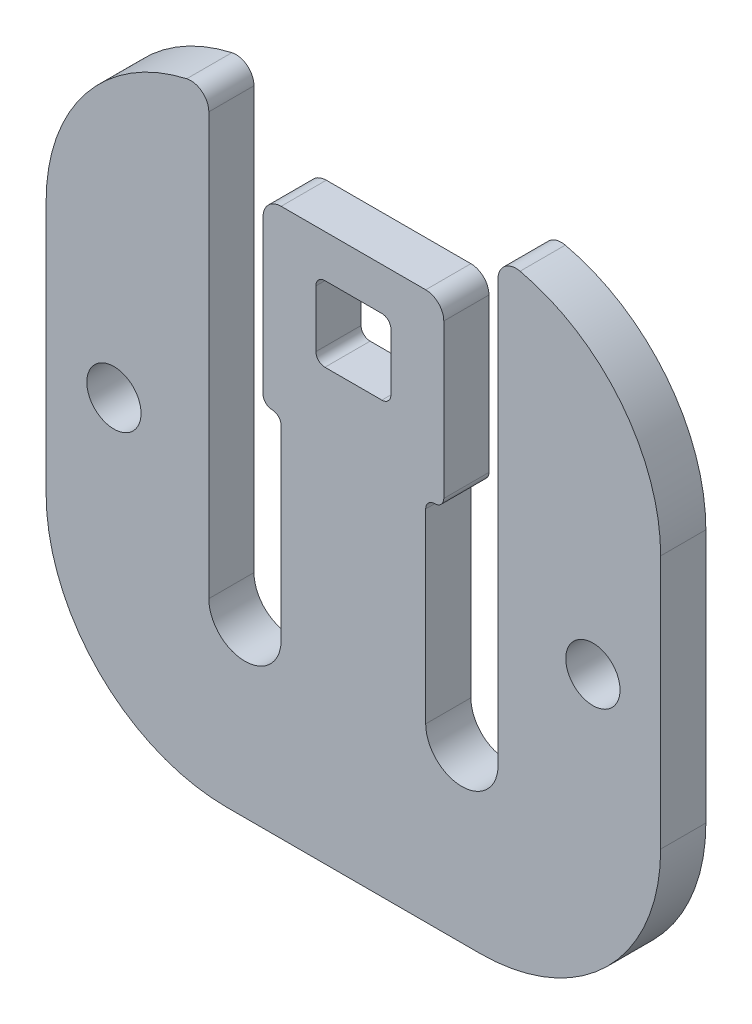
ISO-10303-21;
HEADER;
FILE_DESCRIPTION(('STEP AP214'),'2;1');
FILE_NAME('part.step','',(''),(''),'','','');
FILE_SCHEMA(('AUTOMOTIVE_DESIGN { 1 0 10303 214 1 1 1 1 }'));
ENDSEC;
DATA;
#1=APPLICATION_CONTEXT('core data for automotive mechanical design processes');
#2=APPLICATION_PROTOCOL_DEFINITION('international standard','automotive_design',2000,#1);
#3=PRODUCT_CONTEXT('',#1,'mechanical');
#4=PRODUCT('Part','Part','',(#3));
#5=PRODUCT_RELATED_PRODUCT_CATEGORY('part','',(#4));
#6=PRODUCT_DEFINITION_FORMATION('','',#4);
#7=PRODUCT_DEFINITION_CONTEXT('part definition',#1,'design');
#8=PRODUCT_DEFINITION('design','',#6,#7);
#9=PRODUCT_DEFINITION_SHAPE('','',#8);
#10=(LENGTH_UNIT() NAMED_UNIT(*) SI_UNIT(.MILLI.,.METRE.));
#11=(NAMED_UNIT(*) PLANE_ANGLE_UNIT() SI_UNIT($,.RADIAN.));
#12=(NAMED_UNIT(*) SI_UNIT($,.STERADIAN.) SOLID_ANGLE_UNIT());
#13=UNCERTAINTY_MEASURE_WITH_UNIT(LENGTH_MEASURE(1.E-05),#10,'distance_accuracy_value','');
#14=(GEOMETRIC_REPRESENTATION_CONTEXT(3) GLOBAL_UNCERTAINTY_ASSIGNED_CONTEXT((#13)) GLOBAL_UNIT_ASSIGNED_CONTEXT((#10,
#11,#12)) REPRESENTATION_CONTEXT('',''));
#15=CARTESIAN_POINT('',(0.,0.,0.));
#16=DIRECTION('',(0.,0.,1.));
#17=DIRECTION('',(1.,0.,0.));
#18=AXIS2_PLACEMENT_3D('',#15,#16,#17);
#19=CARTESIAN_POINT('',(-1.575,10.45,0.));
#20=DIRECTION('',(0.,0.,-1.));
#21=DIRECTION('',(-1.,0.,0.));
#22=AXIS2_PLACEMENT_3D('',#19,#20,#21);
#23=CYLINDRICAL_SURFACE('',#22,0.5);
#24=DIRECTION('',(0.,0.,1.));
#25=VECTOR('',#24,1.);
#26=CARTESIAN_POINT('',(-1.575,10.95,0.));
#27=LINE('',#26,#25);
#28=CARTESIAN_POINT('',(-1.575,10.95,0.));
#29=VERTEX_POINT('',#28);
#30=CARTESIAN_POINT('',(-1.575,10.95,2.5));
#31=VERTEX_POINT('',#30);
#32=EDGE_CURVE('E345',#29,#31,#27,.T.);
#33=ORIENTED_EDGE('',*,*,#32,.T.);
#34=CARTESIAN_POINT('',(-1.575,10.45,2.5));
#35=DIRECTION('',(0.,0.,-1.));
#36=DIRECTION('',(-1.,0.,0.));
#37=AXIS2_PLACEMENT_3D('',#34,#35,#36);
#38=CIRCLE('',#37,0.5);
#39=CARTESIAN_POINT('',(-2.075,10.45,2.5));
#40=VERTEX_POINT('',#39);
#41=EDGE_CURVE('E237',#31,#40,#38,.F.);
#42=ORIENTED_EDGE('',*,*,#41,.T.);
#43=DIRECTION('',(0.,0.,1.));
#44=VECTOR('',#43,1.);
#45=CARTESIAN_POINT('',(-2.075,10.45,0.));
#46=LINE('',#45,#44);
#47=CARTESIAN_POINT('',(-2.075,10.45,0.));
#48=VERTEX_POINT('',#47);
#49=EDGE_CURVE('E235',#40,#48,#46,.F.);
#50=ORIENTED_EDGE('',*,*,#49,.T.);
#51=CARTESIAN_POINT('',(-1.575,10.45,0.));
#52=DIRECTION('',(0.,0.,-1.));
#53=DIRECTION('',(-1.,0.,0.));
#54=AXIS2_PLACEMENT_3D('',#51,#52,#53);
#55=CIRCLE('',#54,0.5);
#56=EDGE_CURVE('E20',#29,#48,#55,.F.);
#57=ORIENTED_EDGE('',*,*,#56,.F.);
#58=EDGE_LOOP('',(#33,#42,#50,#57));
#59=FACE_BOUND('',#58,.T.);
#60=ADVANCED_FACE('F17',(#59),#23,.F.);
#61=CARTESIAN_POINT('',(-1.575,7.29999999999999,0.));
#62=DIRECTION('',(0.,0.,-1.));
#63=DIRECTION('',(-1.,0.,0.));
#64=AXIS2_PLACEMENT_3D('',#61,#62,#63);
#65=CYLINDRICAL_SURFACE('',#64,0.5);
#66=DIRECTION('',(0.,0.,1.));
#67=VECTOR('',#66,1.);
#68=CARTESIAN_POINT('',(-2.075,7.29999999999999,0.));
#69=LINE('',#68,#67);
#70=CARTESIAN_POINT('',(-2.075,7.29999999999999,0.));
#71=VERTEX_POINT('',#70);
#72=CARTESIAN_POINT('',(-2.075,7.29999999999999,2.5));
#73=VERTEX_POINT('',#72);
#74=EDGE_CURVE('E241',#71,#73,#69,.T.);
#75=ORIENTED_EDGE('',*,*,#74,.T.);
#76=CARTESIAN_POINT('',(-1.575,7.29999999999999,2.5));
#77=DIRECTION('',(0.,0.,-1.));
#78=DIRECTION('',(-1.,0.,0.));
#79=AXIS2_PLACEMENT_3D('',#76,#77,#78);
#80=CIRCLE('',#79,0.5);
#81=CARTESIAN_POINT('',(-1.575,6.79999999999999,2.5));
#82=VERTEX_POINT('',#81);
#83=EDGE_CURVE('E443',#73,#82,#80,.F.);
#84=ORIENTED_EDGE('',*,*,#83,.T.);
#85=DIRECTION('',(0.,0.,1.));
#86=VECTOR('',#85,1.);
#87=CARTESIAN_POINT('',(-1.575,6.79999999999999,0.));
#88=LINE('',#87,#86);
#89=CARTESIAN_POINT('',(-1.575,6.79999999999999,0.));
#90=VERTEX_POINT('',#89);
#91=EDGE_CURVE('E334',#82,#90,#88,.F.);
#92=ORIENTED_EDGE('',*,*,#91,.T.);
#93=CARTESIAN_POINT('',(-1.575,7.29999999999999,0.));
#94=DIRECTION('',(0.,0.,-1.));
#95=DIRECTION('',(-1.,0.,0.));
#96=AXIS2_PLACEMENT_3D('',#93,#94,#95);
#97=CIRCLE('',#96,0.5);
#98=EDGE_CURVE('E233',#71,#90,#97,.F.);
#99=ORIENTED_EDGE('',*,*,#98,.F.);
#100=EDGE_LOOP('',(#75,#84,#92,#99));
#101=FACE_BOUND('',#100,.T.);
#102=ADVANCED_FACE('F465',(#101),#65,.F.);
#103=CARTESIAN_POINT('',(1.575,10.45,0.));
#104=DIRECTION('',(0.,0.,-1.));
#105=DIRECTION('',(-1.,0.,0.));
#106=AXIS2_PLACEMENT_3D('',#103,#104,#105);
#107=CYLINDRICAL_SURFACE('',#106,0.5);
#108=DIRECTION('',(0.,0.,1.));
#109=VECTOR('',#108,1.);
#110=CARTESIAN_POINT('',(2.075,10.45,0.));
#111=LINE('',#110,#109);
#112=CARTESIAN_POINT('',(2.075,10.45,0.));
#113=VERTEX_POINT('',#112);
#114=CARTESIAN_POINT('',(2.075,10.45,2.5));
#115=VERTEX_POINT('',#114);
#116=EDGE_CURVE('E332',#113,#115,#111,.T.);
#117=ORIENTED_EDGE('',*,*,#116,.T.);
#118=CARTESIAN_POINT('',(1.575,10.45,2.5));
#119=DIRECTION('',(0.,0.,-1.));
#120=DIRECTION('',(-1.,0.,0.));
#121=AXIS2_PLACEMENT_3D('',#118,#119,#120);
#122=CIRCLE('',#121,0.5);
#123=CARTESIAN_POINT('',(1.575,10.95,2.5));
#124=VERTEX_POINT('',#123);
#125=EDGE_CURVE('E446',#115,#124,#122,.F.);
#126=ORIENTED_EDGE('',*,*,#125,.T.);
#127=DIRECTION('',(0.,0.,1.));
#128=VECTOR('',#127,1.);
#129=CARTESIAN_POINT('',(1.575,10.95,0.));
#130=LINE('',#129,#128);
#131=CARTESIAN_POINT('',(1.575,10.95,0.));
#132=VERTEX_POINT('',#131);
#133=EDGE_CURVE('E242',#124,#132,#130,.F.);
#134=ORIENTED_EDGE('',*,*,#133,.T.);
#135=CARTESIAN_POINT('',(1.575,10.45,0.));
#136=DIRECTION('',(0.,0.,-1.));
#137=DIRECTION('',(-1.,0.,0.));
#138=AXIS2_PLACEMENT_3D('',#135,#136,#137);
#139=CIRCLE('',#138,0.5);
#140=EDGE_CURVE('E461',#113,#132,#139,.F.);
#141=ORIENTED_EDGE('',*,*,#140,.F.);
#142=EDGE_LOOP('',(#117,#126,#134,#141));
#143=FACE_BOUND('',#142,.T.);
#144=ADVANCED_FACE('F659',(#143),#107,.F.);
#145=CARTESIAN_POINT('',(1.575,7.29999999999999,0.));
#146=DIRECTION('',(0.,0.,-1.));
#147=DIRECTION('',(-1.,0.,0.));
#148=AXIS2_PLACEMENT_3D('',#145,#146,#147);
#149=CYLINDRICAL_SURFACE('',#148,0.5);
#150=DIRECTION('',(0.,0.,1.));
#151=VECTOR('',#150,1.);
#152=CARTESIAN_POINT('',(1.575,6.79999999999999,0.));
#153=LINE('',#152,#151);
#154=CARTESIAN_POINT('',(1.575,6.79999999999999,0.));
#155=VERTEX_POINT('',#154);
#156=CARTESIAN_POINT('',(1.575,6.79999999999999,2.5));
#157=VERTEX_POINT('',#156);
#158=EDGE_CURVE('E338',#155,#157,#153,.T.);
#159=ORIENTED_EDGE('',*,*,#158,.T.);
#160=CARTESIAN_POINT('',(1.575,7.29999999999999,2.5));
#161=DIRECTION('',(0.,0.,-1.));
#162=DIRECTION('',(-1.,0.,0.));
#163=AXIS2_PLACEMENT_3D('',#160,#161,#162);
#164=CIRCLE('',#163,0.5);
#165=CARTESIAN_POINT('',(2.075,7.3,2.5));
#166=VERTEX_POINT('',#165);
#167=EDGE_CURVE('E448',#157,#166,#164,.F.);
#168=ORIENTED_EDGE('',*,*,#167,.T.);
#169=DIRECTION('',(0.,0.,1.));
#170=VECTOR('',#169,1.);
#171=CARTESIAN_POINT('',(2.075,7.3,0.));
#172=LINE('',#171,#170);
#173=CARTESIAN_POINT('',(2.075,7.3,0.));
#174=VERTEX_POINT('',#173);
#175=EDGE_CURVE('E328',#166,#174,#172,.F.);
#176=ORIENTED_EDGE('',*,*,#175,.T.);
#177=CARTESIAN_POINT('',(1.575,7.29999999999999,0.));
#178=DIRECTION('',(0.,0.,-1.));
#179=DIRECTION('',(-1.,0.,0.));
#180=AXIS2_PLACEMENT_3D('',#177,#178,#179);
#181=CIRCLE('',#180,0.5);
#182=EDGE_CURVE('E459',#155,#174,#181,.F.);
#183=ORIENTED_EDGE('',*,*,#182,.F.);
#184=EDGE_LOOP('',(#159,#168,#176,#183));
#185=FACE_BOUND('',#184,.T.);
#186=ADVANCED_FACE('F473',(#185),#149,.F.);
#187=CARTESIAN_POINT('',(-4.5,2.79999999999999,0.));
#188=DIRECTION('',(0.,0.,1.));
#189=DIRECTION('',(1.,0.,0.));
#190=AXIS2_PLACEMENT_3D('',#187,#188,#189);
#191=CYLINDRICAL_SURFACE('',#190,0.5);
#192=CARTESIAN_POINT('',(-4.5,2.79999999999999,0.));
#193=DIRECTION('',(0.,0.,1.));
#194=DIRECTION('',(1.,0.,0.));
#195=AXIS2_PLACEMENT_3D('',#192,#193,#194);
#196=CIRCLE('',#195,0.5);
#197=CARTESIAN_POINT('',(-4.,2.8,0.));
#198=VERTEX_POINT('',#197);
#199=CARTESIAN_POINT('',(-4.5,3.29999999999999,0.));
#200=VERTEX_POINT('',#199);
#201=EDGE_CURVE('E457',#198,#200,#196,.T.);
#202=ORIENTED_EDGE('',*,*,#201,.F.);
#203=DIRECTION('',(0.,0.,1.));
#204=VECTOR('',#203,1.);
#205=CARTESIAN_POINT('',(-4.,2.8,0.));
#206=LINE('',#205,#204);
#207=CARTESIAN_POINT('',(-4.,2.8,2.5));
#208=VERTEX_POINT('',#207);
#209=EDGE_CURVE('E326',#198,#208,#206,.T.);
#210=ORIENTED_EDGE('',*,*,#209,.T.);
#211=CARTESIAN_POINT('',(-4.5,2.79999999999999,2.5));
#212=DIRECTION('',(0.,0.,1.));
#213=DIRECTION('',(1.,0.,0.));
#214=AXIS2_PLACEMENT_3D('',#211,#212,#213);
#215=CIRCLE('',#214,0.5);
#216=CARTESIAN_POINT('',(-4.5,3.29999999999999,2.5));
#217=VERTEX_POINT('',#216);
#218=EDGE_CURVE('E433',#208,#217,#215,.T.);
#219=ORIENTED_EDGE('',*,*,#218,.T.);
#220=DIRECTION('',(0.,0.,1.));
#221=VECTOR('',#220,1.);
#222=CARTESIAN_POINT('',(-4.5,3.29999999999999,0.));
#223=LINE('',#222,#221);
#224=EDGE_CURVE('E372',#200,#217,#223,.T.);
#225=ORIENTED_EDGE('',*,*,#224,.F.);
#226=EDGE_LOOP('',(#202,#210,#219,#225));
#227=FACE_BOUND('',#226,.T.);
#228=ADVANCED_FACE('F596',(#227),#191,.F.);
#229=CARTESIAN_POINT('',(-4.5,3.79999999999999,0.));
#230=DIRECTION('',(0.,0.,1.));
#231=DIRECTION('',(1.,0.,0.));
#232=AXIS2_PLACEMENT_3D('',#229,#230,#231);
#233=CYLINDRICAL_SURFACE('',#232,0.5);
#234=CARTESIAN_POINT('',(-4.5,3.79999999999999,2.5));
#235=DIRECTION('',(0.,0.,1.));
#236=DIRECTION('',(1.,0.,0.));
#237=AXIS2_PLACEMENT_3D('',#234,#235,#236);
#238=CIRCLE('',#237,0.5);
#239=CARTESIAN_POINT('',(-5.,3.79999999999999,2.5));
#240=VERTEX_POINT('',#239);
#241=EDGE_CURVE('E347',#217,#240,#238,.F.);
#242=ORIENTED_EDGE('',*,*,#241,.T.);
#243=DIRECTION('',(0.,0.,1.));
#244=VECTOR('',#243,1.);
#245=CARTESIAN_POINT('',(-5.,3.79999999999999,0.));
#246=LINE('',#245,#244);
#247=CARTESIAN_POINT('',(-5.,3.79999999999999,0.));
#248=VERTEX_POINT('',#247);
#249=EDGE_CURVE('E319',#248,#240,#246,.T.);
#250=ORIENTED_EDGE('',*,*,#249,.F.);
#251=CARTESIAN_POINT('',(-4.5,3.79999999999999,0.));
#252=DIRECTION('',(0.,0.,1.));
#253=DIRECTION('',(1.,0.,0.));
#254=AXIS2_PLACEMENT_3D('',#251,#252,#253);
#255=CIRCLE('',#254,0.5);
#256=EDGE_CURVE('E376',#248,#200,#255,.T.);
#257=ORIENTED_EDGE('',*,*,#256,.T.);
#258=ORIENTED_EDGE('',*,*,#224,.T.);
#259=EDGE_LOOP('',(#242,#250,#257,#258));
#260=FACE_BOUND('',#259,.T.);
#261=ADVANCED_FACE('F593',(#260),#233,.T.);
#262=CARTESIAN_POINT('',(-4.,12.3,0.));
#263=DIRECTION('',(0.,0.,-1.));
#264=DIRECTION('',(-1.,0.,0.));
#265=AXIS2_PLACEMENT_3D('',#262,#263,#264);
#266=CYLINDRICAL_SURFACE('',#265,1.);
#267=CARTESIAN_POINT('',(-4.,12.3,2.5));
#268=DIRECTION('',(0.,0.,-1.));
#269=DIRECTION('',(-1.,0.,0.));
#270=AXIS2_PLACEMENT_3D('',#267,#268,#269);
#271=CIRCLE('',#270,1.);
#272=CARTESIAN_POINT('',(-5.,12.3,2.5));
#273=VERTEX_POINT('',#272);
#274=CARTESIAN_POINT('',(-4.,13.3,2.5));
#275=VERTEX_POINT('',#274);
#276=EDGE_CURVE('E441',#273,#275,#271,.T.);
#277=ORIENTED_EDGE('',*,*,#276,.T.);
#278=DIRECTION('',(0.,0.,-1.));
#279=VECTOR('',#278,1.);
#280=CARTESIAN_POINT('',(-4.,13.3,0.));
#281=LINE('',#280,#279);
#282=CARTESIAN_POINT('',(-4.,13.3,0.));
#283=VERTEX_POINT('',#282);
#284=EDGE_CURVE('E313',#275,#283,#281,.T.);
#285=ORIENTED_EDGE('',*,*,#284,.T.);
#286=CARTESIAN_POINT('',(-4.,12.3,0.));
#287=DIRECTION('',(0.,0.,-1.));
#288=DIRECTION('',(-1.,0.,0.));
#289=AXIS2_PLACEMENT_3D('',#286,#287,#288);
#290=CIRCLE('',#289,1.);
#291=CARTESIAN_POINT('',(-5.,12.3,0.));
#292=VERTEX_POINT('',#291);
#293=EDGE_CURVE('E375',#283,#292,#290,.F.);
#294=ORIENTED_EDGE('',*,*,#293,.T.);
#295=DIRECTION('',(0.,0.,1.));
#296=VECTOR('',#295,1.);
#297=CARTESIAN_POINT('',(-5.,12.3,0.));
#298=LINE('',#297,#296);
#299=EDGE_CURVE('E317',#273,#292,#298,.F.);
#300=ORIENTED_EDGE('',*,*,#299,.F.);
#301=EDGE_LOOP('',(#277,#285,#294,#300));
#302=FACE_BOUND('',#301,.T.);
#303=ADVANCED_FACE('F584',(#302),#266,.T.);
#304=CARTESIAN_POINT('',(4.,12.3,0.));
#305=DIRECTION('',(0.,0.,1.));
#306=DIRECTION('',(1.,0.,0.));
#307=AXIS2_PLACEMENT_3D('',#304,#305,#306);
#308=CYLINDRICAL_SURFACE('',#307,1.);
#309=CARTESIAN_POINT('',(4.,12.3,2.5));
#310=DIRECTION('',(0.,0.,1.));
#311=DIRECTION('',(1.,0.,0.));
#312=AXIS2_PLACEMENT_3D('',#309,#310,#311);
#313=CIRCLE('',#312,1.);
#314=CARTESIAN_POINT('',(4.,13.3,2.5));
#315=VERTEX_POINT('',#314);
#316=CARTESIAN_POINT('',(5.,12.3,2.5));
#317=VERTEX_POINT('',#316);
#318=EDGE_CURVE('E439',#315,#317,#313,.F.);
#319=ORIENTED_EDGE('',*,*,#318,.T.);
#320=DIRECTION('',(0.,0.,1.));
#321=VECTOR('',#320,1.);
#322=CARTESIAN_POINT('',(5.,12.3,0.));
#323=LINE('',#322,#321);
#324=CARTESIAN_POINT('',(5.,12.3,0.));
#325=VERTEX_POINT('',#324);
#326=EDGE_CURVE('E306',#317,#325,#323,.F.);
#327=ORIENTED_EDGE('',*,*,#326,.T.);
#328=CARTESIAN_POINT('',(4.,12.3,0.));
#329=DIRECTION('',(0.,0.,1.));
#330=DIRECTION('',(1.,0.,0.));
#331=AXIS2_PLACEMENT_3D('',#328,#329,#330);
#332=CIRCLE('',#331,1.);
#333=CARTESIAN_POINT('',(4.,13.3,0.));
#334=VERTEX_POINT('',#333);
#335=EDGE_CURVE('E452',#325,#334,#332,.T.);
#336=ORIENTED_EDGE('',*,*,#335,.T.);
#337=DIRECTION('',(0.,0.,-1.));
#338=VECTOR('',#337,1.);
#339=CARTESIAN_POINT('',(4.,13.3,0.));
#340=LINE('',#339,#338);
#341=EDGE_CURVE('E316',#334,#315,#340,.F.);
#342=ORIENTED_EDGE('',*,*,#341,.T.);
#343=EDGE_LOOP('',(#319,#327,#336,#342));
#344=FACE_BOUND('',#343,.T.);
#345=ADVANCED_FACE('F576',(#344),#308,.T.);
#346=CARTESIAN_POINT('',(4.5,3.79999999999999,0.));
#347=DIRECTION('',(0.,0.,-1.));
#348=DIRECTION('',(-1.,0.,0.));
#349=AXIS2_PLACEMENT_3D('',#346,#347,#348);
#350=CYLINDRICAL_SURFACE('',#349,0.5);
#351=CARTESIAN_POINT('',(4.5,3.79999999999999,2.5));
#352=DIRECTION('',(0.,0.,-1.));
#353=DIRECTION('',(-1.,0.,0.));
#354=AXIS2_PLACEMENT_3D('',#351,#352,#353);
#355=CIRCLE('',#354,0.5);
#356=CARTESIAN_POINT('',(5.,3.79999999999999,2.5));
#357=VERTEX_POINT('',#356);
#358=CARTESIAN_POINT('',(4.5,3.29999999999999,2.5));
#359=VERTEX_POINT('',#358);
#360=EDGE_CURVE('E437',#357,#359,#355,.T.);
#361=ORIENTED_EDGE('',*,*,#360,.T.);
#362=DIRECTION('',(0.,0.,1.));
#363=VECTOR('',#362,1.);
#364=CARTESIAN_POINT('',(4.5,3.29999999999999,0.));
#365=LINE('',#364,#363);
#366=CARTESIAN_POINT('',(4.5,3.29999999999999,0.));
#367=VERTEX_POINT('',#366);
#368=EDGE_CURVE('E377',#359,#367,#365,.F.);
#369=ORIENTED_EDGE('',*,*,#368,.T.);
#370=CARTESIAN_POINT('',(4.5,3.79999999999999,0.));
#371=DIRECTION('',(0.,0.,-1.));
#372=DIRECTION('',(-1.,0.,0.));
#373=AXIS2_PLACEMENT_3D('',#370,#371,#372);
#374=CIRCLE('',#373,0.5);
#375=CARTESIAN_POINT('',(5.,3.79999999999999,0.));
#376=VERTEX_POINT('',#375);
#377=EDGE_CURVE('E380',#367,#376,#374,.F.);
#378=ORIENTED_EDGE('',*,*,#377,.T.);
#379=DIRECTION('',(0.,0.,1.));
#380=VECTOR('',#379,1.);
#381=CARTESIAN_POINT('',(5.,3.79999999999999,0.));
#382=LINE('',#381,#380);
#383=EDGE_CURVE('E309',#376,#357,#382,.T.);
#384=ORIENTED_EDGE('',*,*,#383,.T.);
#385=EDGE_LOOP('',(#361,#369,#378,#384));
#386=FACE_BOUND('',#385,.T.);
#387=ADVANCED_FACE('F567',(#386),#350,.T.);
#388=CARTESIAN_POINT('',(4.5,2.79999999999999,0.));
#389=DIRECTION('',(0.,0.,1.));
#390=DIRECTION('',(1.,0.,0.));
#391=AXIS2_PLACEMENT_3D('',#388,#389,#390);
#392=CYLINDRICAL_SURFACE('',#391,0.5);
#393=CARTESIAN_POINT('',(4.5,2.79999999999999,0.));
#394=DIRECTION('',(0.,0.,1.));
#395=DIRECTION('',(1.,0.,0.));
#396=AXIS2_PLACEMENT_3D('',#393,#394,#395);
#397=CIRCLE('',#396,0.5);
#398=CARTESIAN_POINT('',(4.,2.8,0.));
#399=VERTEX_POINT('',#398);
#400=EDGE_CURVE('E379',#367,#399,#397,.T.);
#401=ORIENTED_EDGE('',*,*,#400,.F.);
#402=ORIENTED_EDGE('',*,*,#368,.F.);
#403=CARTESIAN_POINT('',(4.5,2.79999999999999,2.5));
#404=DIRECTION('',(0.,0.,1.));
#405=DIRECTION('',(1.,0.,0.));
#406=AXIS2_PLACEMENT_3D('',#403,#404,#405);
#407=CIRCLE('',#406,0.5);
#408=CARTESIAN_POINT('',(4.,2.8,2.5));
#409=VERTEX_POINT('',#408);
#410=EDGE_CURVE('E435',#359,#409,#407,.T.);
#411=ORIENTED_EDGE('',*,*,#410,.T.);
#412=DIRECTION('',(0.,0.,1.));
#413=VECTOR('',#412,1.);
#414=CARTESIAN_POINT('',(4.,2.8,0.));
#415=LINE('',#414,#413);
#416=EDGE_CURVE('E302',#409,#399,#415,.F.);
#417=ORIENTED_EDGE('',*,*,#416,.T.);
#418=EDGE_LOOP('',(#401,#402,#411,#417));
#419=FACE_BOUND('',#418,.T.);
#420=ADVANCED_FACE('F564',(#419),#392,.F.);
#421=CARTESIAN_POINT('',(0.,0.,2.5));
#422=DIRECTION('',(0.,0.,-1.));
#423=DIRECTION('',(-1.,0.,0.));
#424=AXIS2_PLACEMENT_3D('',#421,#422,#423);
#425=PLANE('',#424);
#426=ORIENTED_EDGE('',*,*,#241,.F.);
#427=ORIENTED_EDGE('',*,*,#218,.F.);
#428=DIRECTION('',(0.,1.,0.));
#429=VECTOR('',#428,1.);
#430=CARTESIAN_POINT('',(-4.,18.5,2.5));
#431=LINE('',#430,#429);
#432=CARTESIAN_POINT('',(-4.,-7.50000000000001,2.5));
#433=VERTEX_POINT('',#432);
#434=EDGE_CURVE('E323',#208,#433,#431,.F.);
#435=ORIENTED_EDGE('',*,*,#434,.T.);
#436=CARTESIAN_POINT('',(-6.,-7.50000000000001,2.5));
#437=DIRECTION('',(0.,0.,1.));
#438=DIRECTION('',(1.,0.,0.));
#439=AXIS2_PLACEMENT_3D('',#436,#437,#438);
#440=CIRCLE('',#439,2.);
#441=CARTESIAN_POINT('',(-8.,-7.50000000000001,2.5));
#442=VERTEX_POINT('',#441);
#443=EDGE_CURVE('E260',#433,#442,#440,.F.);
#444=ORIENTED_EDGE('',*,*,#443,.T.);
#445=DIRECTION('',(0.,-1.,0.));
#446=VECTOR('',#445,1.);
#447=CARTESIAN_POINT('',(-8.,18.5,2.5));
#448=LINE('',#447,#446);
#449=CARTESIAN_POINT('',(-8.,15.8250900163259,2.5));
#450=VERTEX_POINT('',#449);
#451=EDGE_CURVE('E262',#442,#450,#448,.F.);
#452=ORIENTED_EDGE('',*,*,#451,.T.);
#453=CARTESIAN_POINT('',(-9.,15.8250900163259,2.5));
#454=DIRECTION('',(0.,0.,-1.));
#455=DIRECTION('',(-1.,0.,0.));
#456=AXIS2_PLACEMENT_3D('',#453,#454,#455);
#457=CIRCLE('',#456,1.);
#458=CARTESIAN_POINT('',(-9.22222222222222,16.8000860593695,2.5));
#459=VERTEX_POINT('',#458);
#460=EDGE_CURVE('E266',#459,#450,#457,.T.);
#461=ORIENTED_EDGE('',*,*,#460,.F.);
#462=CARTESIAN_POINT('',(-7.,7.05012562893379,2.5));
#463=DIRECTION('',(0.,0.,-1.));
#464=DIRECTION('',(-1.,0.,0.));
#465=AXIS2_PLACEMENT_3D('',#462,#463,#464);
#466=CIRCLE('',#465,10.);
#467=CARTESIAN_POINT('',(-17.,7.05012562893379,2.5));
#468=VERTEX_POINT('',#467);
#469=EDGE_CURVE('E270',#468,#459,#466,.T.);
#470=ORIENTED_EDGE('',*,*,#469,.F.);
#471=DIRECTION('',(0.,1.,0.));
#472=VECTOR('',#471,1.);
#473=CARTESIAN_POINT('',(-17.,-17.,2.5));
#474=LINE('',#473,#472);
#475=CARTESIAN_POINT('',(-17.,-7.00000000000001,2.5));
#476=VERTEX_POINT('',#475);
#477=EDGE_CURVE('E273',#468,#476,#474,.F.);
#478=ORIENTED_EDGE('',*,*,#477,.T.);
#479=CARTESIAN_POINT('',(-7.,-7.00000000000001,2.5));
#480=DIRECTION('',(0.,0.,-1.));
#481=DIRECTION('',(-1.,0.,0.));
#482=AXIS2_PLACEMENT_3D('',#479,#480,#481);
#483=CIRCLE('',#482,10.);
#484=CARTESIAN_POINT('',(-7.,-17.,2.5));
#485=VERTEX_POINT('',#484);
#486=EDGE_CURVE('E277',#485,#476,#483,.T.);
#487=ORIENTED_EDGE('',*,*,#486,.F.);
#488=DIRECTION('',(1.,0.,0.));
#489=VECTOR('',#488,1.);
#490=CARTESIAN_POINT('',(-17.,-17.,2.5));
#491=LINE('',#490,#489);
#492=CARTESIAN_POINT('',(7.,-17.,2.5));
#493=VERTEX_POINT('',#492);
#494=EDGE_CURVE('E280',#485,#493,#491,.T.);
#495=ORIENTED_EDGE('',*,*,#494,.T.);
#496=CARTESIAN_POINT('',(7.,-7.00000000000001,2.5));
#497=DIRECTION('',(0.,0.,-1.));
#498=DIRECTION('',(-1.,0.,0.));
#499=AXIS2_PLACEMENT_3D('',#496,#497,#498);
#500=CIRCLE('',#499,10.);
#501=CARTESIAN_POINT('',(17.,-7.00000000000001,2.5));
#502=VERTEX_POINT('',#501);
#503=EDGE_CURVE('E284',#502,#493,#500,.T.);
#504=ORIENTED_EDGE('',*,*,#503,.F.);
#505=DIRECTION('',(0.,1.,0.));
#506=VECTOR('',#505,1.);
#507=CARTESIAN_POINT('',(17.,-17.,2.5));
#508=LINE('',#507,#506);
#509=CARTESIAN_POINT('',(17.,7.05012562893379,2.5));
#510=VERTEX_POINT('',#509);
#511=EDGE_CURVE('E287',#502,#510,#508,.T.);
#512=ORIENTED_EDGE('',*,*,#511,.T.);
#513=CARTESIAN_POINT('',(7.,7.05012562893379,2.5));
#514=DIRECTION('',(0.,0.,1.));
#515=DIRECTION('',(1.,0.,0.));
#516=AXIS2_PLACEMENT_3D('',#513,#514,#515);
#517=CIRCLE('',#516,10.);
#518=CARTESIAN_POINT('',(9.22222222222222,16.8000860593695,2.5));
#519=VERTEX_POINT('',#518);
#520=EDGE_CURVE('E291',#519,#510,#517,.F.);
#521=ORIENTED_EDGE('',*,*,#520,.F.);
#522=CARTESIAN_POINT('',(9.,15.8250900163259,2.5));
#523=DIRECTION('',(0.,0.,1.));
#524=DIRECTION('',(1.,0.,0.));
#525=AXIS2_PLACEMENT_3D('',#522,#523,#524);
#526=CIRCLE('',#525,1.);
#527=CARTESIAN_POINT('',(8.,15.8250900163259,2.5));
#528=VERTEX_POINT('',#527);
#529=EDGE_CURVE('E292',#528,#519,#526,.F.);
#530=ORIENTED_EDGE('',*,*,#529,.F.);
#531=DIRECTION('',(0.,1.,0.));
#532=VECTOR('',#531,1.);
#533=CARTESIAN_POINT('',(8.,18.5,2.5));
#534=LINE('',#533,#532);
#535=CARTESIAN_POINT('',(8.,-7.50000000000001,2.5));
#536=VERTEX_POINT('',#535);
#537=EDGE_CURVE('E296',#528,#536,#534,.F.);
#538=ORIENTED_EDGE('',*,*,#537,.T.);
#539=CARTESIAN_POINT('',(6.,-7.50000000000001,2.5));
#540=DIRECTION('',(0.,0.,1.));
#541=DIRECTION('',(1.,0.,0.));
#542=AXIS2_PLACEMENT_3D('',#539,#540,#541);
#543=CIRCLE('',#542,2.);
#544=CARTESIAN_POINT('',(4.,-7.50000000000001,2.5));
#545=VERTEX_POINT('',#544);
#546=EDGE_CURVE('E299',#536,#545,#543,.F.);
#547=ORIENTED_EDGE('',*,*,#546,.T.);
#548=DIRECTION('',(0.,-1.,0.));
#549=VECTOR('',#548,1.);
#550=CARTESIAN_POINT('',(4.,18.5,2.5));
#551=LINE('',#550,#549);
#552=EDGE_CURVE('E305',#545,#409,#551,.F.);
#553=ORIENTED_EDGE('',*,*,#552,.T.);
#554=ORIENTED_EDGE('',*,*,#410,.F.);
#555=ORIENTED_EDGE('',*,*,#360,.F.);
#556=DIRECTION('',(0.,-1.,0.));
#557=VECTOR('',#556,1.);
#558=CARTESIAN_POINT('',(5.,0.,2.5));
#559=LINE('',#558,#557);
#560=EDGE_CURVE('E312',#357,#317,#559,.F.);
#561=ORIENTED_EDGE('',*,*,#560,.T.);
#562=ORIENTED_EDGE('',*,*,#318,.F.);
#563=DIRECTION('',(1.,0.,0.));
#564=VECTOR('',#563,1.);
#565=CARTESIAN_POINT('',(0.,13.3,2.5));
#566=LINE('',#565,#564);
#567=EDGE_CURVE('E310',#315,#275,#566,.F.);
#568=ORIENTED_EDGE('',*,*,#567,.T.);
#569=ORIENTED_EDGE('',*,*,#276,.F.);
#570=DIRECTION('',(0.,-1.,0.));
#571=VECTOR('',#570,1.);
#572=CARTESIAN_POINT('',(-5.,0.,2.5));
#573=LINE('',#572,#571);
#574=EDGE_CURVE('E322',#240,#273,#573,.F.);
#575=ORIENTED_EDGE('',*,*,#574,.F.);
#576=EDGE_LOOP('',(#426,#427,#435,#444,#452,#461,#470,#478,#487,#495,#504,#512,#521,#530,#538,
#547,#553,#554,#555,#561,#562,#568,#569,#575));
#577=FACE_BOUND('',#576,.T.);
#578=CARTESIAN_POINT('',(13.25,-0.500000000000007,2.5));
#579=DIRECTION('',(0.,0.,1.));
#580=DIRECTION('',(1.,0.,0.));
#581=AXIS2_PLACEMENT_3D('',#578,#579,#580);
#582=CIRCLE('',#581,1.5);
#583=CARTESIAN_POINT('',(14.75,-0.500000000000007,2.5));
#584=VERTEX_POINT('',#583);
#585=EDGE_CURVE('E251',#584,#584,#582,.F.);
#586=ORIENTED_EDGE('',*,*,#585,.T.);
#587=EDGE_LOOP('',(#586));
#588=FACE_BOUND('',#587,.T.);
#589=CARTESIAN_POINT('',(-13.25,-0.500000000000007,2.5));
#590=DIRECTION('',(0.,0.,1.));
#591=DIRECTION('',(1.,0.,0.));
#592=AXIS2_PLACEMENT_3D('',#589,#590,#591);
#593=CIRCLE('',#592,1.5);
#594=CARTESIAN_POINT('',(-11.75,-0.500000000000007,2.5));
#595=VERTEX_POINT('',#594);
#596=EDGE_CURVE('E416',#595,#595,#593,.F.);
#597=ORIENTED_EDGE('',*,*,#596,.T.);
#598=EDGE_LOOP('',(#597));
#599=FACE_BOUND('',#598,.T.);
#600=ORIENTED_EDGE('',*,*,#83,.F.);
#601=DIRECTION('',(0.,-1.,0.));
#602=VECTOR('',#601,1.);
#603=CARTESIAN_POINT('',(-2.075,10.95,2.5));
#604=LINE('',#603,#602);
#605=EDGE_CURVE('E339',#73,#40,#604,.F.);
#606=ORIENTED_EDGE('',*,*,#605,.T.);
#607=ORIENTED_EDGE('',*,*,#41,.F.);
#608=DIRECTION('',(1.,0.,0.));
#609=VECTOR('',#608,1.);
#610=CARTESIAN_POINT('',(-2.075,10.95,2.5));
#611=LINE('',#610,#609);
#612=EDGE_CURVE('E344',#31,#124,#611,.T.);
#613=ORIENTED_EDGE('',*,*,#612,.T.);
#614=ORIENTED_EDGE('',*,*,#125,.F.);
#615=DIRECTION('',(0.,1.,0.));
#616=VECTOR('',#615,1.);
#617=CARTESIAN_POINT('',(2.075,10.95,2.5));
#618=LINE('',#617,#616);
#619=EDGE_CURVE('E331',#115,#166,#618,.F.);
#620=ORIENTED_EDGE('',*,*,#619,.T.);
#621=ORIENTED_EDGE('',*,*,#167,.F.);
#622=DIRECTION('',(1.,0.,0.));
#623=VECTOR('',#622,1.);
#624=CARTESIAN_POINT('',(-2.075,6.79999999999999,2.5));
#625=LINE('',#624,#623);
#626=EDGE_CURVE('E337',#157,#82,#625,.F.);
#627=ORIENTED_EDGE('',*,*,#626,.T.);
#628=EDGE_LOOP('',(#600,#606,#607,#613,#614,#620,#621,#627));
#629=FACE_BOUND('',#628,.T.);
#630=ADVANCED_FACE('F475',(#577,#588,#599,#629),#425,.F.);
#631=CARTESIAN_POINT('',(-2.075,10.95,0.));
#632=DIRECTION('',(0.,1.,0.));
#633=DIRECTION('',(0.,0.,1.));
#634=AXIS2_PLACEMENT_3D('',#631,#632,#633);
#635=PLANE('',#634);
#636=ORIENTED_EDGE('',*,*,#133,.F.);
#637=ORIENTED_EDGE('',*,*,#612,.F.);
#638=ORIENTED_EDGE('',*,*,#32,.F.);
#639=DIRECTION('',(-1.,0.,0.));
#640=VECTOR('',#639,1.);
#641=CARTESIAN_POINT('',(0.,10.95,0.));
#642=LINE('',#641,#640);
#643=EDGE_CURVE('E232',#132,#29,#642,.T.);
#644=ORIENTED_EDGE('',*,*,#643,.F.);
#645=EDGE_LOOP('',(#636,#637,#638,#644));
#646=FACE_BOUND('',#645,.T.);
#647=ADVANCED_FACE('F635',(#646),#635,.F.);
#648=CARTESIAN_POINT('',(-2.075,10.95,0.));
#649=DIRECTION('',(-1.,0.,0.));
#650=DIRECTION('',(0.,-1.,0.));
#651=AXIS2_PLACEMENT_3D('',#648,#649,#650);
#652=PLANE('',#651);
#653=ORIENTED_EDGE('',*,*,#74,.F.);
#654=DIRECTION('',(0.,1.,0.));
#655=VECTOR('',#654,1.);
#656=CARTESIAN_POINT('',(-2.075,0.,0.));
#657=LINE('',#656,#655);
#658=EDGE_CURVE('E230',#48,#71,#657,.F.);
#659=ORIENTED_EDGE('',*,*,#658,.F.);
#660=ORIENTED_EDGE('',*,*,#49,.F.);
#661=ORIENTED_EDGE('',*,*,#605,.F.);
#662=EDGE_LOOP('',(#653,#659,#660,#661));
#663=FACE_BOUND('',#662,.T.);
#664=ADVANCED_FACE('F245',(#663),#652,.F.);
#665=CARTESIAN_POINT('',(-2.075,6.79999999999999,0.));
#666=DIRECTION('',(0.,-1.,0.));
#667=DIRECTION('',(1.,0.,0.));
#668=AXIS2_PLACEMENT_3D('',#665,#666,#667);
#669=PLANE('',#668);
#670=ORIENTED_EDGE('',*,*,#91,.F.);
#671=ORIENTED_EDGE('',*,*,#626,.F.);
#672=ORIENTED_EDGE('',*,*,#158,.F.);
#673=DIRECTION('',(-1.,0.,0.));
#674=VECTOR('',#673,1.);
#675=CARTESIAN_POINT('',(0.,6.79999999999999,0.));
#676=LINE('',#675,#674);
#677=EDGE_CURVE('E246',#90,#155,#676,.F.);
#678=ORIENTED_EDGE('',*,*,#677,.F.);
#679=EDGE_LOOP('',(#670,#671,#672,#678));
#680=FACE_BOUND('',#679,.T.);
#681=ADVANCED_FACE('F470',(#680),#669,.F.);
#682=CARTESIAN_POINT('',(2.075,10.95,0.));
#683=DIRECTION('',(1.,0.,0.));
#684=DIRECTION('',(0.,1.,0.));
#685=AXIS2_PLACEMENT_3D('',#682,#683,#684);
#686=PLANE('',#685);
#687=ORIENTED_EDGE('',*,*,#175,.F.);
#688=ORIENTED_EDGE('',*,*,#619,.F.);
#689=ORIENTED_EDGE('',*,*,#116,.F.);
#690=DIRECTION('',(0.,1.,0.));
#691=VECTOR('',#690,1.);
#692=CARTESIAN_POINT('',(2.075,0.,0.));
#693=LINE('',#692,#691);
#694=EDGE_CURVE('E249',#174,#113,#693,.T.);
#695=ORIENTED_EDGE('',*,*,#694,.F.);
#696=EDGE_LOOP('',(#687,#688,#689,#695));
#697=FACE_BOUND('',#696,.T.);
#698=ADVANCED_FACE('F482',(#697),#686,.F.);
#699=CARTESIAN_POINT('',(-4.,18.5,0.));
#700=DIRECTION('',(1.,0.,0.));
#701=DIRECTION('',(0.,1.,0.));
#702=AXIS2_PLACEMENT_3D('',#699,#700,#701);
#703=PLANE('',#702);
#704=ORIENTED_EDGE('',*,*,#209,.F.);
#705=DIRECTION('',(0.,1.,0.));
#706=VECTOR('',#705,1.);
#707=CARTESIAN_POINT('',(-4.,0.,0.));
#708=LINE('',#707,#706);
#709=CARTESIAN_POINT('',(-4.,-7.50000000000001,0.));
#710=VERTEX_POINT('',#709);
#711=EDGE_CURVE('E483',#710,#198,#708,.T.);
#712=ORIENTED_EDGE('',*,*,#711,.F.);
#713=DIRECTION('',(0.,0.,1.));
#714=VECTOR('',#713,1.);
#715=CARTESIAN_POINT('',(-4.,-7.50000000000001,0.));
#716=LINE('',#715,#714);
#717=EDGE_CURVE('E256',#710,#433,#716,.T.);
#718=ORIENTED_EDGE('',*,*,#717,.T.);
#719=ORIENTED_EDGE('',*,*,#434,.F.);
#720=EDGE_LOOP('',(#704,#712,#718,#719));
#721=FACE_BOUND('',#720,.T.);
#722=ADVANCED_FACE('F600',(#721),#703,.F.);
#723=CARTESIAN_POINT('',(-5.,0.,0.));
#724=DIRECTION('',(-1.,0.,0.));
#725=DIRECTION('',(0.,-1.,0.));
#726=AXIS2_PLACEMENT_3D('',#723,#724,#725);
#727=PLANE('',#726);
#728=ORIENTED_EDGE('',*,*,#574,.T.);
#729=ORIENTED_EDGE('',*,*,#299,.T.);
#730=DIRECTION('',(0.,1.,0.));
#731=VECTOR('',#730,1.);
#732=CARTESIAN_POINT('',(-5.,0.,0.));
#733=LINE('',#732,#731);
#734=EDGE_CURVE('E485',#248,#292,#733,.T.);
#735=ORIENTED_EDGE('',*,*,#734,.F.);
#736=ORIENTED_EDGE('',*,*,#249,.T.);
#737=EDGE_LOOP('',(#728,#729,#735,#736));
#738=FACE_BOUND('',#737,.T.);
#739=ADVANCED_FACE('F591',(#738),#727,.T.);
#740=CARTESIAN_POINT('',(0.,13.3,0.));
#741=DIRECTION('',(0.,-1.,0.));
#742=DIRECTION('',(0.,0.,-1.));
#743=AXIS2_PLACEMENT_3D('',#740,#741,#742);
#744=PLANE('',#743);
#745=ORIENTED_EDGE('',*,*,#341,.F.);
#746=DIRECTION('',(-1.,0.,0.));
#747=VECTOR('',#746,1.);
#748=CARTESIAN_POINT('',(0.,13.3,0.));
#749=LINE('',#748,#747);
#750=EDGE_CURVE('E490',#283,#334,#749,.F.);
#751=ORIENTED_EDGE('',*,*,#750,.F.);
#752=ORIENTED_EDGE('',*,*,#284,.F.);
#753=ORIENTED_EDGE('',*,*,#567,.F.);
#754=EDGE_LOOP('',(#745,#751,#752,#753));
#755=FACE_BOUND('',#754,.T.);
#756=ADVANCED_FACE('F581',(#755),#744,.F.);
#757=CARTESIAN_POINT('',(5.,0.,0.));
#758=DIRECTION('',(-1.,0.,0.));
#759=DIRECTION('',(0.,-1.,0.));
#760=AXIS2_PLACEMENT_3D('',#757,#758,#759);
#761=PLANE('',#760);
#762=ORIENTED_EDGE('',*,*,#383,.F.);
#763=DIRECTION('',(0.,1.,0.));
#764=VECTOR('',#763,1.);
#765=CARTESIAN_POINT('',(5.,0.,0.));
#766=LINE('',#765,#764);
#767=EDGE_CURVE('E493',#325,#376,#766,.F.);
#768=ORIENTED_EDGE('',*,*,#767,.F.);
#769=ORIENTED_EDGE('',*,*,#326,.F.);
#770=ORIENTED_EDGE('',*,*,#560,.F.);
#771=EDGE_LOOP('',(#762,#768,#769,#770));
#772=FACE_BOUND('',#771,.T.);
#773=ADVANCED_FACE('F573',(#772),#761,.F.);
#774=CARTESIAN_POINT('',(4.,18.5,0.));
#775=DIRECTION('',(-1.,0.,0.));
#776=DIRECTION('',(0.,-1.,0.));
#777=AXIS2_PLACEMENT_3D('',#774,#775,#776);
#778=PLANE('',#777);
#779=ORIENTED_EDGE('',*,*,#416,.F.);
#780=ORIENTED_EDGE('',*,*,#552,.F.);
#781=DIRECTION('',(0.,0.,1.));
#782=VECTOR('',#781,1.);
#783=CARTESIAN_POINT('',(4.,-7.50000000000001,0.));
#784=LINE('',#783,#782);
#785=CARTESIAN_POINT('',(4.,-7.50000000000001,0.));
#786=VERTEX_POINT('',#785);
#787=EDGE_CURVE('E300',#545,#786,#784,.F.);
#788=ORIENTED_EDGE('',*,*,#787,.T.);
#789=DIRECTION('',(0.,1.,0.));
#790=VECTOR('',#789,1.);
#791=CARTESIAN_POINT('',(4.,0.,0.));
#792=LINE('',#791,#790);
#793=EDGE_CURVE('E413',#399,#786,#792,.F.);
#794=ORIENTED_EDGE('',*,*,#793,.F.);
#795=EDGE_LOOP('',(#779,#780,#788,#794));
#796=FACE_BOUND('',#795,.T.);
#797=ADVANCED_FACE('F561',(#796),#778,.F.);
#798=CARTESIAN_POINT('',(6.,-7.50000000000001,0.));
#799=DIRECTION('',(0.,0.,1.));
#800=DIRECTION('',(1.,0.,0.));
#801=AXIS2_PLACEMENT_3D('',#798,#799,#800);
#802=CYLINDRICAL_SURFACE('',#801,2.);
#803=DIRECTION('',(0.,0.,1.));
#804=VECTOR('',#803,1.);
#805=CARTESIAN_POINT('',(8.,-7.50000000000001,0.));
#806=LINE('',#805,#804);
#807=CARTESIAN_POINT('',(8.,-7.50000000000001,0.));
#808=VERTEX_POINT('',#807);
#809=EDGE_CURVE('E297',#536,#808,#806,.F.);
#810=ORIENTED_EDGE('',*,*,#809,.T.);
#811=CARTESIAN_POINT('',(6.,-7.50000000000001,0.));
#812=DIRECTION('',(0.,0.,1.));
#813=DIRECTION('',(1.,0.,0.));
#814=AXIS2_PLACEMENT_3D('',#811,#812,#813);
#815=CIRCLE('',#814,2.);
#816=EDGE_CURVE('E410',#786,#808,#815,.T.);
#817=ORIENTED_EDGE('',*,*,#816,.F.);
#818=ORIENTED_EDGE('',*,*,#787,.F.);
#819=ORIENTED_EDGE('',*,*,#546,.F.);
#820=EDGE_LOOP('',(#810,#817,#818,#819));
#821=FACE_BOUND('',#820,.T.);
#822=ADVANCED_FACE('F554',(#821),#802,.F.);
#823=CARTESIAN_POINT('',(8.,18.5,0.));
#824=DIRECTION('',(1.,0.,0.));
#825=DIRECTION('',(0.,1.,0.));
#826=AXIS2_PLACEMENT_3D('',#823,#824,#825);
#827=PLANE('',#826);
#828=DIRECTION('',(0.,0.,1.));
#829=VECTOR('',#828,1.);
#830=CARTESIAN_POINT('',(8.,15.8250900163259,2.5));
#831=LINE('',#830,#829);
#832=CARTESIAN_POINT('',(8.,15.8250900163259,0.));
#833=VERTEX_POINT('',#832);
#834=EDGE_CURVE('E293',#833,#528,#831,.T.);
#835=ORIENTED_EDGE('',*,*,#834,.F.);
#836=DIRECTION('',(0.,1.,0.));
#837=VECTOR('',#836,1.);
#838=CARTESIAN_POINT('',(8.,0.,0.));
#839=LINE('',#838,#837);
#840=EDGE_CURVE('E409',#808,#833,#839,.T.);
#841=ORIENTED_EDGE('',*,*,#840,.F.);
#842=ORIENTED_EDGE('',*,*,#809,.F.);
#843=ORIENTED_EDGE('',*,*,#537,.F.);
#844=EDGE_LOOP('',(#835,#841,#842,#843));
#845=FACE_BOUND('',#844,.T.);
#846=ADVANCED_FACE('F551',(#845),#827,.F.);
#847=CARTESIAN_POINT('',(9.,15.8250900163259,2.5));
#848=DIRECTION('',(0.,0.,1.));
#849=DIRECTION('',(1.,0.,0.));
#850=AXIS2_PLACEMENT_3D('',#847,#848,#849);
#851=CYLINDRICAL_SURFACE('',#850,1.);
#852=ORIENTED_EDGE('',*,*,#529,.T.);
#853=DIRECTION('',(0.,0.,1.));
#854=VECTOR('',#853,1.);
#855=CARTESIAN_POINT('',(9.22222222222222,16.8000860593695,2.5));
#856=LINE('',#855,#854);
#857=CARTESIAN_POINT('',(9.22222222222222,16.8000860593695,0.));
#858=VERTEX_POINT('',#857);
#859=EDGE_CURVE('E288',#858,#519,#856,.T.);
#860=ORIENTED_EDGE('',*,*,#859,.F.);
#861=CARTESIAN_POINT('',(9.,15.8250900163259,0.));
#862=DIRECTION('',(0.,0.,1.));
#863=DIRECTION('',(1.,0.,0.));
#864=AXIS2_PLACEMENT_3D('',#861,#862,#863);
#865=CIRCLE('',#864,1.);
#866=EDGE_CURVE('E406',#833,#858,#865,.F.);
#867=ORIENTED_EDGE('',*,*,#866,.F.);
#868=ORIENTED_EDGE('',*,*,#834,.T.);
#869=EDGE_LOOP('',(#852,#860,#867,#868));
#870=FACE_BOUND('',#869,.T.);
#871=ADVANCED_FACE('F548',(#870),#851,.T.);
#872=CARTESIAN_POINT('',(7.,7.05012562893379,2.5));
#873=DIRECTION('',(0.,0.,1.));
#874=DIRECTION('',(1.,0.,0.));
#875=AXIS2_PLACEMENT_3D('',#872,#873,#874);
#876=CYLINDRICAL_SURFACE('',#875,10.);
#877=ORIENTED_EDGE('',*,*,#520,.T.);
#878=DIRECTION('',(0.,0.,1.));
#879=VECTOR('',#878,1.);
#880=CARTESIAN_POINT('',(17.,7.05012562893379,2.5));
#881=LINE('',#880,#879);
#882=CARTESIAN_POINT('',(17.,7.05012562893379,0.));
#883=VERTEX_POINT('',#882);
#884=EDGE_CURVE('E285',#510,#883,#881,.F.);
#885=ORIENTED_EDGE('',*,*,#884,.T.);
#886=CARTESIAN_POINT('',(7.,7.05012562893379,0.));
#887=DIRECTION('',(0.,0.,1.));
#888=DIRECTION('',(1.,0.,0.));
#889=AXIS2_PLACEMENT_3D('',#886,#887,#888);
#890=CIRCLE('',#889,10.);
#891=EDGE_CURVE('E403',#858,#883,#890,.F.);
#892=ORIENTED_EDGE('',*,*,#891,.F.);
#893=ORIENTED_EDGE('',*,*,#859,.T.);
#894=EDGE_LOOP('',(#877,#885,#892,#893));
#895=FACE_BOUND('',#894,.T.);
#896=ADVANCED_FACE('F543',(#895),#876,.T.);
#897=CARTESIAN_POINT('',(17.,-17.,2.5));
#898=DIRECTION('',(-1.,0.,0.));
#899=DIRECTION('',(0.,0.,1.));
#900=AXIS2_PLACEMENT_3D('',#897,#898,#899);
#901=PLANE('',#900);
#902=ORIENTED_EDGE('',*,*,#884,.F.);
#903=ORIENTED_EDGE('',*,*,#511,.F.);
#904=DIRECTION('',(0.,0.,-1.));
#905=VECTOR('',#904,1.);
#906=CARTESIAN_POINT('',(17.,-7.00000000000001,2.5));
#907=LINE('',#906,#905);
#908=CARTESIAN_POINT('',(17.,-7.00000000000001,0.));
#909=VERTEX_POINT('',#908);
#910=EDGE_CURVE('E281',#909,#502,#907,.F.);
#911=ORIENTED_EDGE('',*,*,#910,.F.);
#912=DIRECTION('',(0.,1.,0.));
#913=VECTOR('',#912,1.);
#914=CARTESIAN_POINT('',(17.,0.,0.));
#915=LINE('',#914,#913);
#916=EDGE_CURVE('E402',#883,#909,#915,.F.);
#917=ORIENTED_EDGE('',*,*,#916,.F.);
#918=EDGE_LOOP('',(#902,#903,#911,#917));
#919=FACE_BOUND('',#918,.T.);
#920=ADVANCED_FACE('F540',(#919),#901,.F.);
#921=CARTESIAN_POINT('',(7.,-7.00000000000001,2.5));
#922=DIRECTION('',(0.,0.,-1.));
#923=DIRECTION('',(-1.,0.,0.));
#924=AXIS2_PLACEMENT_3D('',#921,#922,#923);
#925=CYLINDRICAL_SURFACE('',#924,10.);
#926=CARTESIAN_POINT('',(7.,-7.00000000000001,0.));
#927=DIRECTION('',(0.,0.,-1.));
#928=DIRECTION('',(-1.,0.,0.));
#929=AXIS2_PLACEMENT_3D('',#926,#927,#928);
#930=CIRCLE('',#929,10.);
#931=CARTESIAN_POINT('',(7.,-17.,0.));
#932=VERTEX_POINT('',#931);
#933=EDGE_CURVE('E399',#909,#932,#930,.T.);
#934=ORIENTED_EDGE('',*,*,#933,.F.);
#935=ORIENTED_EDGE('',*,*,#910,.T.);
#936=ORIENTED_EDGE('',*,*,#503,.T.);
#937=DIRECTION('',(0.,0.,1.));
#938=VECTOR('',#937,1.);
#939=CARTESIAN_POINT('',(7.,-17.,2.5));
#940=LINE('',#939,#938);
#941=EDGE_CURVE('E278',#493,#932,#940,.F.);
#942=ORIENTED_EDGE('',*,*,#941,.T.);
#943=EDGE_LOOP('',(#934,#935,#936,#942));
#944=FACE_BOUND('',#943,.T.);
#945=ADVANCED_FACE('F535',(#944),#925,.T.);
#946=CARTESIAN_POINT('',(-17.,-17.,2.5));
#947=DIRECTION('',(0.,1.,0.));
#948=DIRECTION('',(0.,0.,1.));
#949=AXIS2_PLACEMENT_3D('',#946,#947,#948);
#950=PLANE('',#949);
#951=DIRECTION('',(0.,0.,-1.));
#952=VECTOR('',#951,1.);
#953=CARTESIAN_POINT('',(-7.,-17.,2.5));
#954=LINE('',#953,#952);
#955=CARTESIAN_POINT('',(-7.,-17.,0.));
#956=VERTEX_POINT('',#955);
#957=EDGE_CURVE('E274',#956,#485,#954,.F.);
#958=ORIENTED_EDGE('',*,*,#957,.F.);
#959=DIRECTION('',(-1.,0.,0.));
#960=VECTOR('',#959,1.);
#961=CARTESIAN_POINT('',(0.,-17.,0.));
#962=LINE('',#961,#960);
#963=EDGE_CURVE('E398',#932,#956,#962,.T.);
#964=ORIENTED_EDGE('',*,*,#963,.F.);
#965=ORIENTED_EDGE('',*,*,#941,.F.);
#966=ORIENTED_EDGE('',*,*,#494,.F.);
#967=EDGE_LOOP('',(#958,#964,#965,#966));
#968=FACE_BOUND('',#967,.T.);
#969=ADVANCED_FACE('F528',(#968),#950,.F.);
#970=CARTESIAN_POINT('',(-7.,-7.00000000000001,2.5));
#971=DIRECTION('',(0.,0.,-1.));
#972=DIRECTION('',(-1.,0.,0.));
#973=AXIS2_PLACEMENT_3D('',#970,#971,#972);
#974=CYLINDRICAL_SURFACE('',#973,10.);
#975=CARTESIAN_POINT('',(-7.,-7.00000000000001,0.));
#976=DIRECTION('',(0.,0.,-1.));
#977=DIRECTION('',(-1.,0.,0.));
#978=AXIS2_PLACEMENT_3D('',#975,#976,#977);
#979=CIRCLE('',#978,10.);
#980=CARTESIAN_POINT('',(-17.,-7.00000000000001,0.));
#981=VERTEX_POINT('',#980);
#982=EDGE_CURVE('E395',#956,#981,#979,.T.);
#983=ORIENTED_EDGE('',*,*,#982,.F.);
#984=ORIENTED_EDGE('',*,*,#957,.T.);
#985=ORIENTED_EDGE('',*,*,#486,.T.);
#986=DIRECTION('',(0.,0.,-1.));
#987=VECTOR('',#986,1.);
#988=CARTESIAN_POINT('',(-17.,-7.00000000000001,2.5));
#989=LINE('',#988,#987);
#990=EDGE_CURVE('E271',#476,#981,#989,.T.);
#991=ORIENTED_EDGE('',*,*,#990,.T.);
#992=EDGE_LOOP('',(#983,#984,#985,#991));
#993=FACE_BOUND('',#992,.T.);
#994=ADVANCED_FACE('F531',(#993),#974,.T.);
#995=CARTESIAN_POINT('',(-17.,-17.,2.5));
#996=DIRECTION('',(1.,0.,0.));
#997=DIRECTION('',(0.,0.,-1.));
#998=AXIS2_PLACEMENT_3D('',#995,#996,#997);
#999=PLANE('',#998);
#1000=DIRECTION('',(0.,0.,-1.));
#1001=VECTOR('',#1000,1.);
#1002=CARTESIAN_POINT('',(-17.,7.05012562893379,2.5));
#1003=LINE('',#1002,#1001);
#1004=CARTESIAN_POINT('',(-17.,7.05012562893379,0.));
#1005=VERTEX_POINT('',#1004);
#1006=EDGE_CURVE('E267',#1005,#468,#1003,.F.);
#1007=ORIENTED_EDGE('',*,*,#1006,.F.);
#1008=DIRECTION('',(0.,1.,0.));
#1009=VECTOR('',#1008,1.);
#1010=CARTESIAN_POINT('',(-17.,0.,0.));
#1011=LINE('',#1010,#1009);
#1012=EDGE_CURVE('E394',#981,#1005,#1011,.T.);
#1013=ORIENTED_EDGE('',*,*,#1012,.F.);
#1014=ORIENTED_EDGE('',*,*,#990,.F.);
#1015=ORIENTED_EDGE('',*,*,#477,.F.);
#1016=EDGE_LOOP('',(#1007,#1013,#1014,#1015));
#1017=FACE_BOUND('',#1016,.T.);
#1018=ADVANCED_FACE('F522',(#1017),#999,.F.);
#1019=CARTESIAN_POINT('',(-7.,7.05012562893379,2.5));
#1020=DIRECTION('',(0.,0.,-1.));
#1021=DIRECTION('',(-1.,0.,0.));
#1022=AXIS2_PLACEMENT_3D('',#1019,#1020,#1021);
#1023=CYLINDRICAL_SURFACE('',#1022,10.);
#1024=CARTESIAN_POINT('',(-7.,7.05012562893379,0.));
#1025=DIRECTION('',(0.,0.,-1.));
#1026=DIRECTION('',(-1.,0.,0.));
#1027=AXIS2_PLACEMENT_3D('',#1024,#1025,#1026);
#1028=CIRCLE('',#1027,10.);
#1029=CARTESIAN_POINT('',(-9.22222222222222,16.8000860593695,0.));
#1030=VERTEX_POINT('',#1029);
#1031=EDGE_CURVE('E391',#1005,#1030,#1028,.T.);
#1032=ORIENTED_EDGE('',*,*,#1031,.F.);
#1033=ORIENTED_EDGE('',*,*,#1006,.T.);
#1034=ORIENTED_EDGE('',*,*,#469,.T.);
#1035=DIRECTION('',(0.,0.,-1.));
#1036=VECTOR('',#1035,1.);
#1037=CARTESIAN_POINT('',(-9.22222222222222,16.8000860593695,2.5));
#1038=LINE('',#1037,#1036);
#1039=EDGE_CURVE('E263',#1030,#459,#1038,.F.);
#1040=ORIENTED_EDGE('',*,*,#1039,.F.);
#1041=EDGE_LOOP('',(#1032,#1033,#1034,#1040));
#1042=FACE_BOUND('',#1041,.T.);
#1043=ADVANCED_FACE('F519',(#1042),#1023,.T.);
#1044=CARTESIAN_POINT('',(-9.,15.8250900163259,2.5));
#1045=DIRECTION('',(0.,0.,-1.));
#1046=DIRECTION('',(-1.,0.,0.));
#1047=AXIS2_PLACEMENT_3D('',#1044,#1045,#1046);
#1048=CYLINDRICAL_SURFACE('',#1047,1.);
#1049=CARTESIAN_POINT('',(-9.,15.8250900163259,0.));
#1050=DIRECTION('',(0.,0.,-1.));
#1051=DIRECTION('',(-1.,0.,0.));
#1052=AXIS2_PLACEMENT_3D('',#1049,#1050,#1051);
#1053=CIRCLE('',#1052,1.);
#1054=CARTESIAN_POINT('',(-8.,15.8250900163259,0.));
#1055=VERTEX_POINT('',#1054);
#1056=EDGE_CURVE('E388',#1030,#1055,#1053,.T.);
#1057=ORIENTED_EDGE('',*,*,#1056,.F.);
#1058=ORIENTED_EDGE('',*,*,#1039,.T.);
#1059=ORIENTED_EDGE('',*,*,#460,.T.);
#1060=DIRECTION('',(0.,0.,1.));
#1061=VECTOR('',#1060,1.);
#1062=CARTESIAN_POINT('',(-8.,15.8250900163259,0.));
#1063=LINE('',#1062,#1061);
#1064=EDGE_CURVE('E257',#450,#1055,#1063,.F.);
#1065=ORIENTED_EDGE('',*,*,#1064,.T.);
#1066=EDGE_LOOP('',(#1057,#1058,#1059,#1065));
#1067=FACE_BOUND('',#1066,.T.);
#1068=ADVANCED_FACE('F512',(#1067),#1048,.T.);
#1069=CARTESIAN_POINT('',(-8.,18.5,0.));
#1070=DIRECTION('',(-1.,0.,0.));
#1071=DIRECTION('',(0.,-1.,0.));
#1072=AXIS2_PLACEMENT_3D('',#1069,#1070,#1071);
#1073=PLANE('',#1072);
#1074=ORIENTED_EDGE('',*,*,#1064,.F.);
#1075=ORIENTED_EDGE('',*,*,#451,.F.);
#1076=DIRECTION('',(0.,0.,1.));
#1077=VECTOR('',#1076,1.);
#1078=CARTESIAN_POINT('',(-8.,-7.50000000000001,0.));
#1079=LINE('',#1078,#1077);
#1080=CARTESIAN_POINT('',(-8.,-7.50000000000001,0.));
#1081=VERTEX_POINT('',#1080);
#1082=EDGE_CURVE('E35',#442,#1081,#1079,.F.);
#1083=ORIENTED_EDGE('',*,*,#1082,.T.);
#1084=DIRECTION('',(0.,1.,0.));
#1085=VECTOR('',#1084,1.);
#1086=CARTESIAN_POINT('',(-8.,0.,0.));
#1087=LINE('',#1086,#1085);
#1088=EDGE_CURVE('E387',#1055,#1081,#1087,.F.);
#1089=ORIENTED_EDGE('',*,*,#1088,.F.);
#1090=EDGE_LOOP('',(#1074,#1075,#1083,#1089));
#1091=FACE_BOUND('',#1090,.T.);
#1092=ADVANCED_FACE('F510',(#1091),#1073,.F.);
#1093=CARTESIAN_POINT('',(-6.,-7.50000000000001,0.));
#1094=DIRECTION('',(0.,0.,1.));
#1095=DIRECTION('',(1.,0.,0.));
#1096=AXIS2_PLACEMENT_3D('',#1093,#1094,#1095);
#1097=CYLINDRICAL_SURFACE('',#1096,2.);
#1098=ORIENTED_EDGE('',*,*,#717,.F.);
#1099=CARTESIAN_POINT('',(-6.,-7.50000000000001,0.));
#1100=DIRECTION('',(0.,0.,1.));
#1101=DIRECTION('',(1.,0.,0.));
#1102=AXIS2_PLACEMENT_3D('',#1099,#1100,#1101);
#1103=CIRCLE('',#1102,2.);
#1104=EDGE_CURVE('E384',#1081,#710,#1103,.T.);
#1105=ORIENTED_EDGE('',*,*,#1104,.F.);
#1106=ORIENTED_EDGE('',*,*,#1082,.F.);
#1107=ORIENTED_EDGE('',*,*,#443,.F.);
#1108=EDGE_LOOP('',(#1098,#1105,#1106,#1107));
#1109=FACE_BOUND('',#1108,.T.);
#1110=ADVANCED_FACE('F604',(#1109),#1097,.F.);
#1111=CARTESIAN_POINT('',(-13.25,-0.500000000000007,0.));
#1112=DIRECTION('',(0.,0.,1.));
#1113=DIRECTION('',(1.,0.,0.));
#1114=AXIS2_PLACEMENT_3D('',#1111,#1112,#1113);
#1115=CYLINDRICAL_SURFACE('',#1114,1.5);
#1116=ORIENTED_EDGE('',*,*,#596,.F.);
#1117=EDGE_LOOP('',(#1116));
#1118=FACE_BOUND('',#1117,.T.);
#1119=CARTESIAN_POINT('',(-13.25,-0.500000000000007,0.));
#1120=DIRECTION('',(0.,0.,1.));
#1121=DIRECTION('',(1.,0.,0.));
#1122=AXIS2_PLACEMENT_3D('',#1119,#1120,#1121);
#1123=CIRCLE('',#1122,1.5);
#1124=CARTESIAN_POINT('',(-11.75,-0.500000000000007,0.));
#1125=VERTEX_POINT('',#1124);
#1126=EDGE_CURVE('E26',#1125,#1125,#1123,.T.);
#1127=ORIENTED_EDGE('',*,*,#1126,.F.);
#1128=EDGE_LOOP('',(#1127));
#1129=FACE_BOUND('',#1128,.T.);
#1130=ADVANCED_FACE('F606',(#1118,#1129),#1115,.F.);
#1131=CARTESIAN_POINT('',(13.25,-0.500000000000007,0.));
#1132=DIRECTION('',(0.,0.,1.));
#1133=DIRECTION('',(1.,0.,0.));
#1134=AXIS2_PLACEMENT_3D('',#1131,#1132,#1133);
#1135=CYLINDRICAL_SURFACE('',#1134,1.5);
#1136=ORIENTED_EDGE('',*,*,#585,.F.);
#1137=EDGE_LOOP('',(#1136));
#1138=FACE_BOUND('',#1137,.T.);
#1139=CARTESIAN_POINT('',(13.25,-0.500000000000007,0.));
#1140=DIRECTION('',(0.,0.,1.));
#1141=DIRECTION('',(1.,0.,0.));
#1142=AXIS2_PLACEMENT_3D('',#1139,#1140,#1141);
#1143=CIRCLE('',#1142,1.5);
#1144=CARTESIAN_POINT('',(14.75,-0.500000000000007,0.));
#1145=VERTEX_POINT('',#1144);
#1146=EDGE_CURVE('E11',#1145,#1145,#1143,.T.);
#1147=ORIENTED_EDGE('',*,*,#1146,.F.);
#1148=EDGE_LOOP('',(#1147));
#1149=FACE_BOUND('',#1148,.T.);
#1150=ADVANCED_FACE('F613',(#1138,#1149),#1135,.F.);
#1151=CARTESIAN_POINT('',(0.,0.,0.));
#1152=DIRECTION('',(0.,0.,-1.));
#1153=DIRECTION('',(-1.,0.,0.));
#1154=AXIS2_PLACEMENT_3D('',#1151,#1152,#1153);
#1155=PLANE('',#1154);
#1156=ORIENTED_EDGE('',*,*,#1146,.T.);
#1157=EDGE_LOOP('',(#1156));
#1158=FACE_BOUND('',#1157,.T.);
#1159=ORIENTED_EDGE('',*,*,#1126,.T.);
#1160=EDGE_LOOP('',(#1159));
#1161=FACE_BOUND('',#1160,.T.);
#1162=ORIENTED_EDGE('',*,*,#1088,.T.);
#1163=ORIENTED_EDGE('',*,*,#1104,.T.);
#1164=ORIENTED_EDGE('',*,*,#711,.T.);
#1165=ORIENTED_EDGE('',*,*,#201,.T.);
#1166=ORIENTED_EDGE('',*,*,#256,.F.);
#1167=ORIENTED_EDGE('',*,*,#734,.T.);
#1168=ORIENTED_EDGE('',*,*,#293,.F.);
#1169=ORIENTED_EDGE('',*,*,#750,.T.);
#1170=ORIENTED_EDGE('',*,*,#335,.F.);
#1171=ORIENTED_EDGE('',*,*,#767,.T.);
#1172=ORIENTED_EDGE('',*,*,#377,.F.);
#1173=ORIENTED_EDGE('',*,*,#400,.T.);
#1174=ORIENTED_EDGE('',*,*,#793,.T.);
#1175=ORIENTED_EDGE('',*,*,#816,.T.);
#1176=ORIENTED_EDGE('',*,*,#840,.T.);
#1177=ORIENTED_EDGE('',*,*,#866,.T.);
#1178=ORIENTED_EDGE('',*,*,#891,.T.);
#1179=ORIENTED_EDGE('',*,*,#916,.T.);
#1180=ORIENTED_EDGE('',*,*,#933,.T.);
#1181=ORIENTED_EDGE('',*,*,#963,.T.);
#1182=ORIENTED_EDGE('',*,*,#982,.T.);
#1183=ORIENTED_EDGE('',*,*,#1012,.T.);
#1184=ORIENTED_EDGE('',*,*,#1031,.T.);
#1185=ORIENTED_EDGE('',*,*,#1056,.T.);
#1186=EDGE_LOOP('',(#1162,#1163,#1164,#1165,#1166,#1167,#1168,#1169,#1170,#1171,#1172,#1173,
#1174,#1175,#1176,#1177,#1178,#1179,#1180,#1181,#1182,#1183,#1184,#1185));
#1187=FACE_BOUND('',#1186,.T.);
#1188=ORIENTED_EDGE('',*,*,#694,.T.);
#1189=ORIENTED_EDGE('',*,*,#140,.T.);
#1190=ORIENTED_EDGE('',*,*,#643,.T.);
#1191=ORIENTED_EDGE('',*,*,#56,.T.);
#1192=ORIENTED_EDGE('',*,*,#658,.T.);
#1193=ORIENTED_EDGE('',*,*,#98,.T.);
#1194=ORIENTED_EDGE('',*,*,#677,.T.);
#1195=ORIENTED_EDGE('',*,*,#182,.T.);
#1196=EDGE_LOOP('',(#1188,#1189,#1190,#1191,#1192,#1193,#1194,#1195));
#1197=FACE_BOUND('',#1196,.T.);
#1198=ADVANCED_FACE('F228',(#1158,#1161,#1187,#1197),#1155,.T.);
#1199=CLOSED_SHELL('',(#60,#102,#144,#186,#228,#261,#303,#345,#387,#420,#630,#647,#664,#681,
#698,#722,#739,#756,#773,#797,#822,#846,#871,#896,#920,#945,#969,#994,#1018,#1043,#1068,#1092,
#1110,#1130,#1150,#1198));
#1200=MANIFOLD_SOLID_BREP('B1',#1199);
#1201=ADVANCED_BREP_SHAPE_REPRESENTATION('',(#18,#1200),#14);
#1202=SHAPE_DEFINITION_REPRESENTATION(#9,#1201);
ENDSEC;
END-ISO-10303-21;
